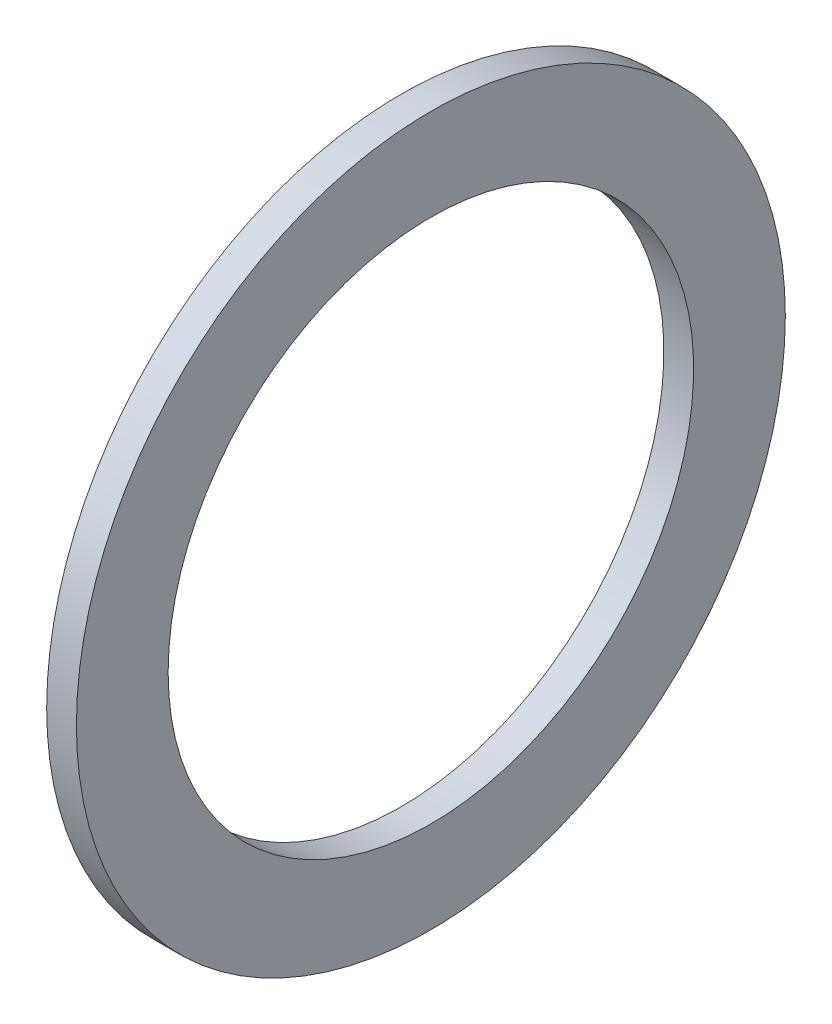
ISO-10303-21;
HEADER;
FILE_DESCRIPTION(('STEP AP214'),'2;1');
FILE_NAME('part.step','',(''),(''),'','','');
FILE_SCHEMA(('AUTOMOTIVE_DESIGN { 1 0 10303 214 1 1 1 1 }'));
ENDSEC;
DATA;
#1=APPLICATION_CONTEXT('core data for automotive mechanical design processes');
#2=APPLICATION_PROTOCOL_DEFINITION('international standard','automotive_design',2000,#1);
#3=PRODUCT_CONTEXT('',#1,'mechanical');
#4=PRODUCT('Part','Part','',(#3));
#5=PRODUCT_RELATED_PRODUCT_CATEGORY('part','',(#4));
#6=PRODUCT_DEFINITION_FORMATION('','',#4);
#7=PRODUCT_DEFINITION_CONTEXT('part definition',#1,'design');
#8=PRODUCT_DEFINITION('design','',#6,#7);
#9=PRODUCT_DEFINITION_SHAPE('','',#8);
#10=(LENGTH_UNIT() NAMED_UNIT(*) SI_UNIT(.MILLI.,.METRE.));
#11=(NAMED_UNIT(*) PLANE_ANGLE_UNIT() SI_UNIT($,.RADIAN.));
#12=(NAMED_UNIT(*) SI_UNIT($,.STERADIAN.) SOLID_ANGLE_UNIT());
#13=UNCERTAINTY_MEASURE_WITH_UNIT(LENGTH_MEASURE(1.E-05),#10,'distance_accuracy_value','');
#14=(GEOMETRIC_REPRESENTATION_CONTEXT(3) GLOBAL_UNCERTAINTY_ASSIGNED_CONTEXT((#13)) GLOBAL_UNIT_ASSIGNED_CONTEXT((#10,
#11,#12)) REPRESENTATION_CONTEXT('',''));
#15=CARTESIAN_POINT('',(0.,0.,0.));
#16=DIRECTION('',(0.,0.,1.));
#17=DIRECTION('',(1.,0.,0.));
#18=AXIS2_PLACEMENT_3D('',#15,#16,#17);
#19=CARTESIAN_POINT('',(0.,-13.462,0.));
#20=DIRECTION('',(-1.,0.,0.));
#21=DIRECTION('',(0.,0.,1.));
#22=AXIS2_PLACEMENT_3D('',#19,#20,#21);
#23=PLANE('',#22);
#24=CARTESIAN_POINT('',(0.,0.,0.));
#25=DIRECTION('',(-1.,0.,0.));
#26=DIRECTION('',(0.,0.,1.));
#27=AXIS2_PLACEMENT_3D('',#24,#25,#26);
#28=CIRCLE('',#27,18.161);
#29=CARTESIAN_POINT('',(0.,0.,18.161));
#30=VERTEX_POINT('',#29);
#31=EDGE_CURVE('E10',#30,#30,#28,.T.);
#32=ORIENTED_EDGE('',*,*,#31,.T.);
#33=EDGE_LOOP('',(#32));
#34=FACE_BOUND('',#33,.T.);
#35=CARTESIAN_POINT('',(0.,0.,0.));
#36=DIRECTION('',(-1.,0.,0.));
#37=DIRECTION('',(0.,0.,1.));
#38=AXIS2_PLACEMENT_3D('',#35,#36,#37);
#39=CIRCLE('',#38,13.462);
#40=CARTESIAN_POINT('',(0.,0.,13.462));
#41=VERTEX_POINT('',#40);
#42=EDGE_CURVE('E43',#41,#41,#39,.T.);
#43=ORIENTED_EDGE('',*,*,#42,.F.);
#44=EDGE_LOOP('',(#43));
#45=FACE_BOUND('',#44,.T.);
#46=ADVANCED_FACE('F29',(#34,#45),#23,.T.);
#47=CARTESIAN_POINT('',(-43.7165807560137,0.,0.));
#48=DIRECTION('',(-1.,0.,0.));
#49=DIRECTION('',(0.,0.,1.));
#50=AXIS2_PLACEMENT_3D('',#47,#48,#49);
#51=CYLINDRICAL_SURFACE('',#50,18.161);
#52=CARTESIAN_POINT('',(1.524,0.,0.));
#53=DIRECTION('',(-1.,0.,0.));
#54=DIRECTION('',(0.,0.,1.));
#55=AXIS2_PLACEMENT_3D('',#52,#53,#54);
#56=CIRCLE('',#55,18.161);
#57=CARTESIAN_POINT('',(1.524,0.,18.161));
#58=VERTEX_POINT('',#57);
#59=EDGE_CURVE('E35',#58,#58,#56,.T.);
#60=ORIENTED_EDGE('',*,*,#59,.T.);
#61=EDGE_LOOP('',(#60));
#62=FACE_BOUND('',#61,.T.);
#63=ORIENTED_EDGE('',*,*,#31,.F.);
#64=EDGE_LOOP('',(#63));
#65=FACE_BOUND('',#64,.T.);
#66=ADVANCED_FACE('F53',(#62,#65),#51,.T.);
#67=CARTESIAN_POINT('',(1.524,-13.462,0.));
#68=DIRECTION('',(1.,0.,0.));
#69=DIRECTION('',(0.,0.,-1.));
#70=AXIS2_PLACEMENT_3D('',#67,#68,#69);
#71=PLANE('',#70);
#72=CARTESIAN_POINT('',(1.524,0.,0.));
#73=DIRECTION('',(-1.,0.,0.));
#74=DIRECTION('',(0.,0.,1.));
#75=AXIS2_PLACEMENT_3D('',#72,#73,#74);
#76=CIRCLE('',#75,13.462);
#77=CARTESIAN_POINT('',(1.524,0.,13.462));
#78=VERTEX_POINT('',#77);
#79=EDGE_CURVE('E39',#78,#78,#76,.T.);
#80=ORIENTED_EDGE('',*,*,#79,.T.);
#81=EDGE_LOOP('',(#80));
#82=FACE_BOUND('',#81,.T.);
#83=ORIENTED_EDGE('',*,*,#59,.F.);
#84=EDGE_LOOP('',(#83));
#85=FACE_BOUND('',#84,.T.);
#86=ADVANCED_FACE('F57',(#82,#85),#71,.T.);
#87=CARTESIAN_POINT('',(-43.7165807560137,0.,0.));
#88=DIRECTION('',(-1.,0.,0.));
#89=DIRECTION('',(0.,0.,1.));
#90=AXIS2_PLACEMENT_3D('',#87,#88,#89);
#91=CYLINDRICAL_SURFACE('',#90,13.462);
#92=ORIENTED_EDGE('',*,*,#42,.T.);
#93=EDGE_LOOP('',(#92));
#94=FACE_BOUND('',#93,.T.);
#95=ORIENTED_EDGE('',*,*,#79,.F.);
#96=EDGE_LOOP('',(#95));
#97=FACE_BOUND('',#96,.T.);
#98=ADVANCED_FACE('F49',(#94,#97),#91,.F.);
#99=CLOSED_SHELL('',(#46,#66,#86,#98));
#100=MANIFOLD_SOLID_BREP('B2',#99);
#101=ADVANCED_BREP_SHAPE_REPRESENTATION('',(#18,#100),#14);
#102=SHAPE_DEFINITION_REPRESENTATION(#9,#101);
ENDSEC;
END-ISO-10303-21;
